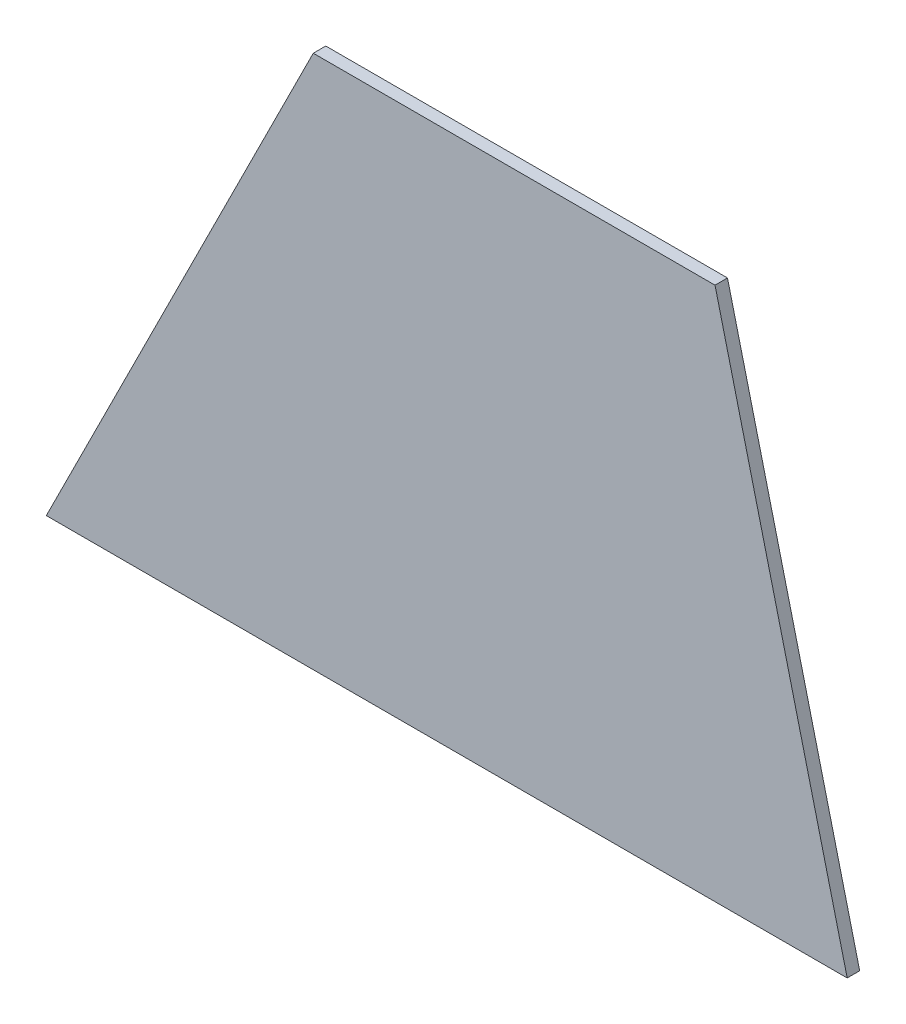
ISO-10303-21;
HEADER;
FILE_DESCRIPTION(('STEP AP214'),'2;1');
FILE_NAME('part.step','',(''),(''),'','','');
FILE_SCHEMA(('AUTOMOTIVE_DESIGN { 1 0 10303 214 1 1 1 1 }'));
ENDSEC;
DATA;
#1=APPLICATION_CONTEXT('core data for automotive mechanical design processes');
#2=APPLICATION_PROTOCOL_DEFINITION('international standard','automotive_design',2000,#1);
#3=PRODUCT_CONTEXT('',#1,'mechanical');
#4=PRODUCT('Part','Part','',(#3));
#5=PRODUCT_RELATED_PRODUCT_CATEGORY('part','',(#4));
#6=PRODUCT_DEFINITION_FORMATION('','',#4);
#7=PRODUCT_DEFINITION_CONTEXT('part definition',#1,'design');
#8=PRODUCT_DEFINITION('design','',#6,#7);
#9=PRODUCT_DEFINITION_SHAPE('','',#8);
#10=(LENGTH_UNIT() NAMED_UNIT(*) SI_UNIT(.MILLI.,.METRE.));
#11=(NAMED_UNIT(*) PLANE_ANGLE_UNIT() SI_UNIT($,.RADIAN.));
#12=(NAMED_UNIT(*) SI_UNIT($,.STERADIAN.) SOLID_ANGLE_UNIT());
#13=UNCERTAINTY_MEASURE_WITH_UNIT(LENGTH_MEASURE(1.E-05),#10,'distance_accuracy_value','');
#14=(GEOMETRIC_REPRESENTATION_CONTEXT(3) GLOBAL_UNCERTAINTY_ASSIGNED_CONTEXT((#13)) GLOBAL_UNIT_ASSIGNED_CONTEXT((#10,
#11,#12)) REPRESENTATION_CONTEXT('',''));
#15=CARTESIAN_POINT('',(0.,0.,0.));
#16=DIRECTION('',(0.,0.,1.));
#17=DIRECTION('',(1.,0.,0.));
#18=AXIS2_PLACEMENT_3D('',#15,#16,#17);
#19=CARTESIAN_POINT('',(-217.714285714286,-58.0571428571428,4.7498));
#20=DIRECTION('',(0.89442719099991,-0.44721359549997,0.));
#21=DIRECTION('',(0.44721359549997,0.89442719099991,0.));
#22=AXIS2_PLACEMENT_3D('',#19,#20,#21);
#23=PLANE('',#22);
#24=DIRECTION('',(-0.44721359549997,-0.89442719099991,0.));
#25=VECTOR('',#24,1.);
#26=CARTESIAN_POINT('',(-217.714285714286,-58.0571428571428,0.));
#27=LINE('',#26,#25);
#28=CARTESIAN_POINT('',(-116.114285714286,145.14285714285,0.));
#29=VERTEX_POINT('',#28);
#30=CARTESIAN_POINT('',(-217.714285714286,-58.0571428571428,0.));
#31=VERTEX_POINT('',#30);
#32=EDGE_CURVE('E96',#29,#31,#27,.T.);
#33=ORIENTED_EDGE('',*,*,#32,.T.);
#34=DIRECTION('',(0.,0.,-1.));
#35=VECTOR('',#34,1.);
#36=CARTESIAN_POINT('',(-217.714285714286,-58.0571428571428,4.7498));
#37=LINE('',#36,#35);
#38=CARTESIAN_POINT('',(-217.714285714286,-58.0571428571428,4.7498));
#39=VERTEX_POINT('',#38);
#40=EDGE_CURVE('E11',#39,#31,#37,.T.);
#41=ORIENTED_EDGE('',*,*,#40,.F.);
#42=DIRECTION('',(-0.44721359549997,-0.89442719099991,0.));
#43=VECTOR('',#42,1.);
#44=CARTESIAN_POINT('',(-217.714285714286,-58.0571428571428,4.7498));
#45=LINE('',#44,#43);
#46=CARTESIAN_POINT('',(-116.114285714286,145.14285714285,4.7498));
#47=VERTEX_POINT('',#46);
#48=EDGE_CURVE('E84',#47,#39,#45,.T.);
#49=ORIENTED_EDGE('',*,*,#48,.F.);
#50=DIRECTION('',(0.,0.,-1.));
#51=VECTOR('',#50,1.);
#52=CARTESIAN_POINT('',(-116.114285714286,145.14285714285,4.7498));
#53=LINE('',#52,#51);
#54=EDGE_CURVE('E92',#47,#29,#53,.T.);
#55=ORIENTED_EDGE('',*,*,#54,.T.);
#56=EDGE_LOOP('',(#33,#41,#49,#55));
#57=FACE_BOUND('',#56,.T.);
#58=ADVANCED_FACE('F33',(#57),#23,.F.);
#59=CARTESIAN_POINT('',(-217.714285714286,-58.0571428571428,4.7498));
#60=DIRECTION('',(0.,1.,0.));
#61=DIRECTION('',(0.,0.,1.));
#62=AXIS2_PLACEMENT_3D('',#59,#60,#61);
#63=PLANE('',#62);
#64=DIRECTION('',(1.,0.,0.));
#65=VECTOR('',#64,1.);
#66=CARTESIAN_POINT('',(-217.714285714286,-58.0571428571428,0.));
#67=LINE('',#66,#65);
#68=CARTESIAN_POINT('',(87.0857142857143,-58.0571428571428,0.));
#69=VERTEX_POINT('',#68);
#70=EDGE_CURVE('E88',#31,#69,#67,.T.);
#71=ORIENTED_EDGE('',*,*,#70,.T.);
#72=DIRECTION('',(0.,0.,-1.));
#73=VECTOR('',#72,1.);
#74=CARTESIAN_POINT('',(87.0857142857143,-58.0571428571428,4.7498));
#75=LINE('',#74,#73);
#76=CARTESIAN_POINT('',(87.0857142857143,-58.0571428571428,4.7498));
#77=VERTEX_POINT('',#76);
#78=EDGE_CURVE('E41',#77,#69,#75,.T.);
#79=ORIENTED_EDGE('',*,*,#78,.F.);
#80=DIRECTION('',(1.,0.,0.));
#81=VECTOR('',#80,1.);
#82=CARTESIAN_POINT('',(-217.714285714286,-58.0571428571428,4.7498));
#83=LINE('',#82,#81);
#84=EDGE_CURVE('E79',#39,#77,#83,.T.);
#85=ORIENTED_EDGE('',*,*,#84,.F.);
#86=ORIENTED_EDGE('',*,*,#40,.T.);
#87=EDGE_LOOP('',(#71,#79,#85,#86));
#88=FACE_BOUND('',#87,.T.);
#89=ADVANCED_FACE('F87',(#88),#63,.F.);
#90=CARTESIAN_POINT('',(36.7777144080803,145.14285714285,4.7498));
#91=DIRECTION('',(-0.970692990159984,-0.240322946998968,0.));
#92=DIRECTION('',(0.240322946998968,-0.970692990159984,0.));
#93=AXIS2_PLACEMENT_3D('',#90,#91,#92);
#94=PLANE('',#93);
#95=DIRECTION('',(-0.240322946998968,0.970692990159984,0.));
#96=VECTOR('',#95,1.);
#97=CARTESIAN_POINT('',(36.7777144080803,145.14285714285,0.));
#98=LINE('',#97,#96);
#99=CARTESIAN_POINT('',(36.7777144080803,145.14285714285,0.));
#100=VERTEX_POINT('',#99);
#101=EDGE_CURVE('E66',#69,#100,#98,.T.);
#102=ORIENTED_EDGE('',*,*,#101,.T.);
#103=DIRECTION('',(0.,0.,-1.));
#104=VECTOR('',#103,1.);
#105=CARTESIAN_POINT('',(36.7777144080803,145.14285714285,4.7498));
#106=LINE('',#105,#104);
#107=CARTESIAN_POINT('',(36.7777144080803,145.14285714285,4.7498));
#108=VERTEX_POINT('',#107);
#109=EDGE_CURVE('E89',#108,#100,#106,.T.);
#110=ORIENTED_EDGE('',*,*,#109,.F.);
#111=DIRECTION('',(-0.240322946998968,0.970692990159984,0.));
#112=VECTOR('',#111,1.);
#113=CARTESIAN_POINT('',(36.7777144080803,145.14285714285,4.7498));
#114=LINE('',#113,#112);
#115=EDGE_CURVE('E82',#77,#108,#114,.T.);
#116=ORIENTED_EDGE('',*,*,#115,.F.);
#117=ORIENTED_EDGE('',*,*,#78,.T.);
#118=EDGE_LOOP('',(#102,#110,#116,#117));
#119=FACE_BOUND('',#118,.T.);
#120=ADVANCED_FACE('F90',(#119),#94,.F.);
#121=CARTESIAN_POINT('',(-116.114285714286,145.14285714285,4.7498));
#122=DIRECTION('',(0.,-1.,0.));
#123=DIRECTION('',(0.,0.,-1.));
#124=AXIS2_PLACEMENT_3D('',#121,#122,#123);
#125=PLANE('',#124);
#126=DIRECTION('',(-1.,0.,0.));
#127=VECTOR('',#126,1.);
#128=CARTESIAN_POINT('',(-116.114285714286,145.14285714285,0.));
#129=LINE('',#128,#127);
#130=EDGE_CURVE('E72',#100,#29,#129,.T.);
#131=ORIENTED_EDGE('',*,*,#130,.T.);
#132=ORIENTED_EDGE('',*,*,#54,.F.);
#133=DIRECTION('',(-1.,0.,0.));
#134=VECTOR('',#133,1.);
#135=CARTESIAN_POINT('',(-116.114285714286,145.14285714285,4.7498));
#136=LINE('',#135,#134);
#137=EDGE_CURVE('E49',#108,#47,#136,.T.);
#138=ORIENTED_EDGE('',*,*,#137,.F.);
#139=ORIENTED_EDGE('',*,*,#109,.T.);
#140=EDGE_LOOP('',(#131,#132,#138,#139));
#141=FACE_BOUND('',#140,.T.);
#142=ADVANCED_FACE('F103',(#141),#125,.F.);
#143=CARTESIAN_POINT('',(0.,0.,4.7498));
#144=DIRECTION('',(0.,0.,-1.));
#145=DIRECTION('',(-1.,0.,0.));
#146=AXIS2_PLACEMENT_3D('',#143,#144,#145);
#147=PLANE('',#146);
#148=ORIENTED_EDGE('',*,*,#48,.T.);
#149=ORIENTED_EDGE('',*,*,#84,.T.);
#150=ORIENTED_EDGE('',*,*,#115,.T.);
#151=ORIENTED_EDGE('',*,*,#137,.T.);
#152=EDGE_LOOP('',(#148,#149,#150,#151));
#153=FACE_BOUND('',#152,.T.);
#154=ADVANCED_FACE('F80',(#153),#147,.F.);
#155=CARTESIAN_POINT('',(0.,0.,0.));
#156=DIRECTION('',(0.,0.,-1.));
#157=DIRECTION('',(-1.,0.,0.));
#158=AXIS2_PLACEMENT_3D('',#155,#156,#157);
#159=PLANE('',#158);
#160=ORIENTED_EDGE('',*,*,#32,.F.);
#161=ORIENTED_EDGE('',*,*,#130,.F.);
#162=ORIENTED_EDGE('',*,*,#101,.F.);
#163=ORIENTED_EDGE('',*,*,#70,.F.);
#164=EDGE_LOOP('',(#160,#161,#162,#163));
#165=FACE_BOUND('',#164,.T.);
#166=ADVANCED_FACE('F106',(#165),#159,.T.);
#167=CLOSED_SHELL('',(#58,#89,#120,#142,#154,#166));
#168=MANIFOLD_SOLID_BREP('B2',#167);
#169=ADVANCED_BREP_SHAPE_REPRESENTATION('',(#18,#168),#14);
#170=SHAPE_DEFINITION_REPRESENTATION(#9,#169);
ENDSEC;
END-ISO-10303-21;
